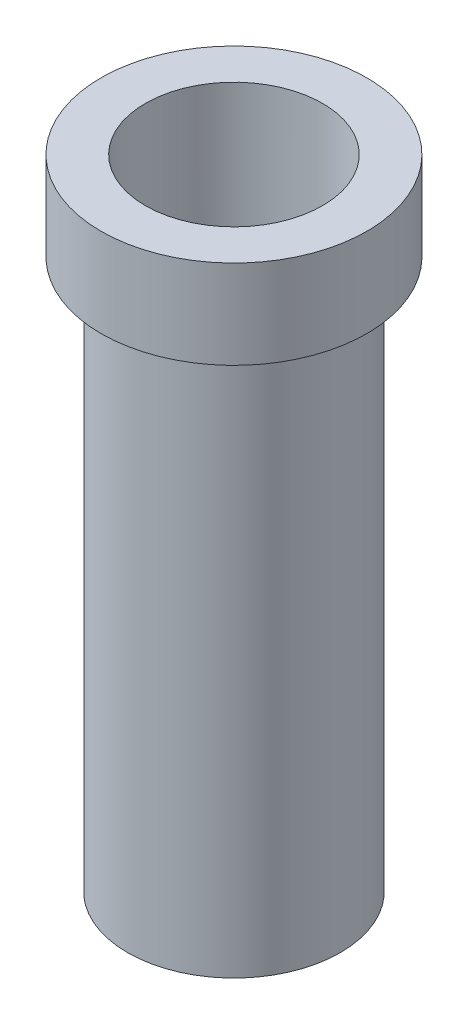
ISO-10303-21;
HEADER;
FILE_DESCRIPTION(('STEP AP214'),'2;1');
FILE_NAME('part.step','',(''),(''),'','','');
FILE_SCHEMA(('AUTOMOTIVE_DESIGN { 1 0 10303 214 1 1 1 1 }'));
ENDSEC;
DATA;
#1=APPLICATION_CONTEXT('core data for automotive mechanical design processes');
#2=APPLICATION_PROTOCOL_DEFINITION('international standard','automotive_design',2000,#1);
#3=PRODUCT_CONTEXT('',#1,'mechanical');
#4=PRODUCT('Part','Part','',(#3));
#5=PRODUCT_RELATED_PRODUCT_CATEGORY('part','',(#4));
#6=PRODUCT_DEFINITION_FORMATION('','',#4);
#7=PRODUCT_DEFINITION_CONTEXT('part definition',#1,'design');
#8=PRODUCT_DEFINITION('design','',#6,#7);
#9=PRODUCT_DEFINITION_SHAPE('','',#8);
#10=(LENGTH_UNIT() NAMED_UNIT(*) SI_UNIT(.MILLI.,.METRE.));
#11=(NAMED_UNIT(*) PLANE_ANGLE_UNIT() SI_UNIT($,.RADIAN.));
#12=(NAMED_UNIT(*) SI_UNIT($,.STERADIAN.) SOLID_ANGLE_UNIT());
#13=UNCERTAINTY_MEASURE_WITH_UNIT(LENGTH_MEASURE(1.E-05),#10,'distance_accuracy_value','');
#14=(GEOMETRIC_REPRESENTATION_CONTEXT(3) GLOBAL_UNCERTAINTY_ASSIGNED_CONTEXT((#13)) GLOBAL_UNIT_ASSIGNED_CONTEXT((#10,
#11,#12)) REPRESENTATION_CONTEXT('',''));
#15=CARTESIAN_POINT('',(0.,0.,0.));
#16=DIRECTION('',(0.,0.,1.));
#17=DIRECTION('',(1.,0.,0.));
#18=AXIS2_PLACEMENT_3D('',#15,#16,#17);
#19=CARTESIAN_POINT('',(0.,0.,0.));
#20=DIRECTION('',(0.,1.,0.));
#21=DIRECTION('',(0.,0.,1.));
#22=AXIS2_PLACEMENT_3D('',#19,#20,#21);
#23=PLANE('',#22);
#24=CARTESIAN_POINT('',(0.,0.,0.));
#25=DIRECTION('',(0.,1.,0.));
#26=DIRECTION('',(0.,0.,1.));
#27=AXIS2_PLACEMENT_3D('',#24,#25,#26);
#28=CIRCLE('',#27,7.5);
#29=CARTESIAN_POINT('',(0.,0.,7.5));
#30=VERTEX_POINT('',#29);
#31=EDGE_CURVE('E42',#30,#30,#28,.T.);
#32=ORIENTED_EDGE('',*,*,#31,.F.);
#33=EDGE_LOOP('',(#32));
#34=FACE_BOUND('',#33,.T.);
#35=CARTESIAN_POINT('',(0.,0.,0.));
#36=DIRECTION('',(0.,1.,0.));
#37=DIRECTION('',(0.,0.,1.));
#38=AXIS2_PLACEMENT_3D('',#35,#36,#37);
#39=CIRCLE('',#38,6.);
#40=CARTESIAN_POINT('',(0.,0.,6.));
#41=VERTEX_POINT('',#40);
#42=EDGE_CURVE('E10',#41,#41,#39,.F.);
#43=ORIENTED_EDGE('',*,*,#42,.F.);
#44=EDGE_LOOP('',(#43));
#45=FACE_BOUND('',#44,.T.);
#46=ADVANCED_FACE('F31',(#34,#45),#23,.F.);
#47=CARTESIAN_POINT('',(0.,5.,0.));
#48=DIRECTION('',(0.,-1.,0.));
#49=DIRECTION('',(0.,0.,-1.));
#50=AXIS2_PLACEMENT_3D('',#47,#48,#49);
#51=CYLINDRICAL_SURFACE('',#50,7.5);
#52=CARTESIAN_POINT('',(0.,5.,0.));
#53=DIRECTION('',(0.,1.,0.));
#54=DIRECTION('',(0.,0.,1.));
#55=AXIS2_PLACEMENT_3D('',#52,#53,#54);
#56=CIRCLE('',#55,7.5);
#57=CARTESIAN_POINT('',(0.,5.,7.5));
#58=VERTEX_POINT('',#57);
#59=EDGE_CURVE('E38',#58,#58,#56,.T.);
#60=ORIENTED_EDGE('',*,*,#59,.F.);
#61=EDGE_LOOP('',(#60));
#62=FACE_BOUND('',#61,.T.);
#63=ORIENTED_EDGE('',*,*,#31,.T.);
#64=EDGE_LOOP('',(#63));
#65=FACE_BOUND('',#64,.T.);
#66=ADVANCED_FACE('F33',(#62,#65),#51,.T.);
#67=CARTESIAN_POINT('',(0.,5.,0.));
#68=DIRECTION('',(0.,1.,0.));
#69=DIRECTION('',(0.,0.,1.));
#70=AXIS2_PLACEMENT_3D('',#67,#68,#69);
#71=PLANE('',#70);
#72=CARTESIAN_POINT('',(0.,5.,0.));
#73=DIRECTION('',(0.,1.,0.));
#74=DIRECTION('',(0.,0.,1.));
#75=AXIS2_PLACEMENT_3D('',#72,#73,#74);
#76=CIRCLE('',#75,5.);
#77=CARTESIAN_POINT('',(0.,5.,5.));
#78=VERTEX_POINT('',#77);
#79=EDGE_CURVE('E51',#78,#78,#76,.T.);
#80=ORIENTED_EDGE('',*,*,#79,.F.);
#81=EDGE_LOOP('',(#80));
#82=FACE_BOUND('',#81,.T.);
#83=ORIENTED_EDGE('',*,*,#59,.T.);
#84=EDGE_LOOP('',(#83));
#85=FACE_BOUND('',#84,.T.);
#86=ADVANCED_FACE('F60',(#82,#85),#71,.T.);
#87=CARTESIAN_POINT('',(0.,-31.,0.));
#88=DIRECTION('',(0.,1.,0.));
#89=DIRECTION('',(0.,0.,1.));
#90=AXIS2_PLACEMENT_3D('',#87,#88,#89);
#91=CYLINDRICAL_SURFACE('',#90,6.);
#92=CARTESIAN_POINT('',(0.,-31.,0.));
#93=DIRECTION('',(0.,-1.,0.));
#94=DIRECTION('',(0.,0.,-1.));
#95=AXIS2_PLACEMENT_3D('',#92,#93,#94);
#96=CIRCLE('',#95,6.);
#97=CARTESIAN_POINT('',(0.,-31.,-6.));
#98=VERTEX_POINT('',#97);
#99=EDGE_CURVE('E47',#98,#98,#96,.T.);
#100=ORIENTED_EDGE('',*,*,#99,.F.);
#101=EDGE_LOOP('',(#100));
#102=FACE_BOUND('',#101,.T.);
#103=ORIENTED_EDGE('',*,*,#42,.T.);
#104=EDGE_LOOP('',(#103));
#105=FACE_BOUND('',#104,.T.);
#106=ADVANCED_FACE('F62',(#102,#105),#91,.T.);
#107=CARTESIAN_POINT('',(0.,-31.,0.));
#108=DIRECTION('',(0.,-1.,0.));
#109=DIRECTION('',(0.,0.,-1.));
#110=AXIS2_PLACEMENT_3D('',#107,#108,#109);
#111=PLANE('',#110);
#112=CARTESIAN_POINT('',(0.,-31.,0.));
#113=DIRECTION('',(0.,-1.,0.));
#114=DIRECTION('',(0.,0.,-1.));
#115=AXIS2_PLACEMENT_3D('',#112,#113,#114);
#116=CIRCLE('',#115,5.);
#117=CARTESIAN_POINT('',(0.,-31.,-5.));
#118=VERTEX_POINT('',#117);
#119=EDGE_CURVE('E52',#118,#118,#116,.F.);
#120=ORIENTED_EDGE('',*,*,#119,.T.);
#121=EDGE_LOOP('',(#120));
#122=FACE_BOUND('',#121,.T.);
#123=ORIENTED_EDGE('',*,*,#99,.T.);
#124=EDGE_LOOP('',(#123));
#125=FACE_BOUND('',#124,.T.);
#126=ADVANCED_FACE('F68',(#122,#125),#111,.T.);
#127=CARTESIAN_POINT('',(0.,-31.001,0.));
#128=DIRECTION('',(0.,1.,0.));
#129=DIRECTION('',(0.,0.,1.));
#130=AXIS2_PLACEMENT_3D('',#127,#128,#129);
#131=CYLINDRICAL_SURFACE('',#130,5.);
#132=ORIENTED_EDGE('',*,*,#119,.F.);
#133=EDGE_LOOP('',(#132));
#134=FACE_BOUND('',#133,.T.);
#135=ORIENTED_EDGE('',*,*,#79,.T.);
#136=EDGE_LOOP('',(#135));
#137=FACE_BOUND('',#136,.T.);
#138=ADVANCED_FACE('F58',(#134,#137),#131,.F.);
#139=CLOSED_SHELL('',(#46,#66,#86,#106,#126,#138));
#140=MANIFOLD_SOLID_BREP('B2',#139);
#141=ADVANCED_BREP_SHAPE_REPRESENTATION('',(#18,#140),#14);
#142=SHAPE_DEFINITION_REPRESENTATION(#9,#141);
ENDSEC;
END-ISO-10303-21;
